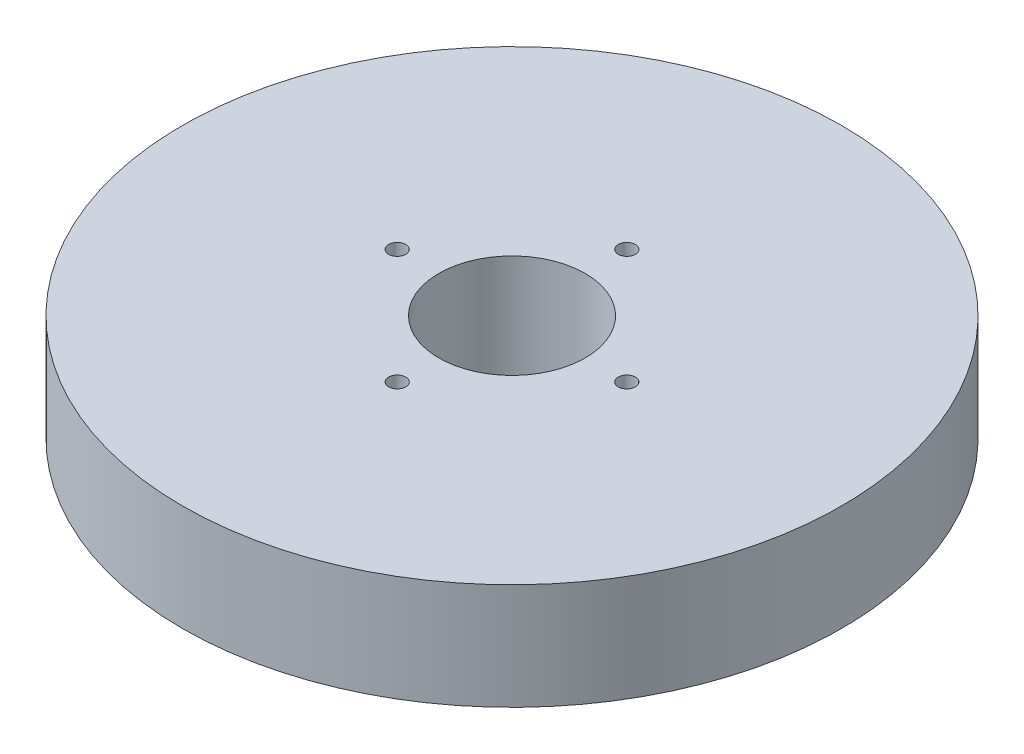
ISO-10303-21;
HEADER;
FILE_DESCRIPTION(('STEP AP214'),'2;1');
FILE_NAME('part.step','',(''),(''),'','','');
FILE_SCHEMA(('AUTOMOTIVE_DESIGN { 1 0 10303 214 1 1 1 1 }'));
ENDSEC;
DATA;
#1=APPLICATION_CONTEXT('core data for automotive mechanical design processes');
#2=APPLICATION_PROTOCOL_DEFINITION('international standard','automotive_design',2000,#1);
#3=PRODUCT_CONTEXT('',#1,'mechanical');
#4=PRODUCT('Part','Part','',(#3));
#5=PRODUCT_RELATED_PRODUCT_CATEGORY('part','',(#4));
#6=PRODUCT_DEFINITION_FORMATION('','',#4);
#7=PRODUCT_DEFINITION_CONTEXT('part definition',#1,'design');
#8=PRODUCT_DEFINITION('design','',#6,#7);
#9=PRODUCT_DEFINITION_SHAPE('','',#8);
#10=(LENGTH_UNIT() NAMED_UNIT(*) SI_UNIT(.MILLI.,.METRE.));
#11=(NAMED_UNIT(*) PLANE_ANGLE_UNIT() SI_UNIT($,.RADIAN.));
#12=(NAMED_UNIT(*) SI_UNIT($,.STERADIAN.) SOLID_ANGLE_UNIT());
#13=UNCERTAINTY_MEASURE_WITH_UNIT(LENGTH_MEASURE(1.E-05),#10,'distance_accuracy_value','');
#14=(GEOMETRIC_REPRESENTATION_CONTEXT(3) GLOBAL_UNCERTAINTY_ASSIGNED_CONTEXT((#13)) GLOBAL_UNIT_ASSIGNED_CONTEXT((#10,
#11,#12)) REPRESENTATION_CONTEXT('',''));
#15=CARTESIAN_POINT('',(0.,0.,0.));
#16=DIRECTION('',(0.,0.,1.));
#17=DIRECTION('',(1.,0.,0.));
#18=AXIS2_PLACEMENT_3D('',#15,#16,#17);
#19=CARTESIAN_POINT('',(0.,29.,0.));
#20=DIRECTION('',(0.,-1.,0.));
#21=DIRECTION('',(0.,0.,-1.));
#22=AXIS2_PLACEMENT_3D('',#19,#20,#21);
#23=CYLINDRICAL_SURFACE('',#22,90.);
#24=CARTESIAN_POINT('',(0.,29.,0.));
#25=DIRECTION('',(0.,1.,0.));
#26=DIRECTION('',(0.,0.,1.));
#27=AXIS2_PLACEMENT_3D('',#24,#25,#26);
#28=CIRCLE('',#27,90.);
#29=CARTESIAN_POINT('',(0.,29.,-90.));
#30=VERTEX_POINT('',#29);
#31=EDGE_CURVE('E10',#30,#30,#28,.T.);
#32=CARTESIAN_POINT('',(0.,0.,0.));
#33=DIRECTION('',(0.,1.,0.));
#34=DIRECTION('',(0.,0.,1.));
#35=AXIS2_PLACEMENT_3D('',#32,#33,#34);
#36=CIRCLE('',#35,90.);
#37=CARTESIAN_POINT('',(0.,0.,-90.));
#38=VERTEX_POINT('',#37);
#39=EDGE_CURVE('E37',#38,#38,#36,.T.);
#40=CARTESIAN_POINT('',(0.,29.,-90.));
#41=CARTESIAN_POINT('',(0.,28.6979166666667,-90.));
#42=CARTESIAN_POINT('',(0.,28.3958333333333,-90.));
#43=CARTESIAN_POINT('',(0.,27.7916666666667,-90.));
#44=CARTESIAN_POINT('',(0.,27.4895833333333,-90.));
#45=CARTESIAN_POINT('',(0.,26.8854166666667,-90.));
#46=CARTESIAN_POINT('',(0.,26.5833333333333,-90.));
#47=CARTESIAN_POINT('',(0.,25.9791666666667,-90.));
#48=CARTESIAN_POINT('',(0.,25.6770833333333,-90.));
#49=CARTESIAN_POINT('',(0.,25.0729166666667,-90.));
#50=CARTESIAN_POINT('',(0.,24.7708333333333,-90.));
#51=CARTESIAN_POINT('',(0.,24.1666666666667,-90.));
#52=CARTESIAN_POINT('',(0.,23.8645833333333,-90.));
#53=CARTESIAN_POINT('',(0.,23.2604166666667,-90.));
#54=CARTESIAN_POINT('',(0.,22.9583333333333,-90.));
#55=CARTESIAN_POINT('',(0.,22.3541666666667,-90.));
#56=CARTESIAN_POINT('',(0.,22.0520833333333,-90.));
#57=CARTESIAN_POINT('',(0.,21.4479166666667,-90.));
#58=CARTESIAN_POINT('',(0.,21.1458333333333,-90.));
#59=CARTESIAN_POINT('',(0.,20.5416666666667,-90.));
#60=CARTESIAN_POINT('',(0.,20.2395833333333,-90.));
#61=CARTESIAN_POINT('',(0.,19.6354166666667,-90.));
#62=CARTESIAN_POINT('',(0.,19.3333333333333,-90.));
#63=CARTESIAN_POINT('',(0.,18.7291666666667,-90.));
#64=CARTESIAN_POINT('',(0.,18.4270833333333,-90.));
#65=CARTESIAN_POINT('',(0.,17.8229166666667,-90.));
#66=CARTESIAN_POINT('',(0.,17.5208333333333,-90.));
#67=CARTESIAN_POINT('',(0.,16.9166666666667,-90.));
#68=CARTESIAN_POINT('',(0.,16.6145833333333,-90.));
#69=CARTESIAN_POINT('',(0.,16.0104166666667,-90.));
#70=CARTESIAN_POINT('',(0.,15.7083333333333,-90.));
#71=CARTESIAN_POINT('',(0.,15.1041666666667,-90.));
#72=CARTESIAN_POINT('',(0.,14.8020833333333,-90.));
#73=CARTESIAN_POINT('',(0.,14.1979166666667,-90.));
#74=CARTESIAN_POINT('',(0.,13.8958333333333,-90.));
#75=CARTESIAN_POINT('',(0.,13.2916666666667,-90.));
#76=CARTESIAN_POINT('',(0.,12.9895833333333,-90.));
#77=CARTESIAN_POINT('',(0.,12.3854166666667,-90.));
#78=CARTESIAN_POINT('',(0.,12.0833333333333,-90.));
#79=CARTESIAN_POINT('',(0.,11.4791666666667,-90.));
#80=CARTESIAN_POINT('',(0.,11.1770833333333,-90.));
#81=CARTESIAN_POINT('',(0.,10.5729166666667,-90.));
#82=CARTESIAN_POINT('',(0.,10.2708333333333,-90.));
#83=CARTESIAN_POINT('',(0.,9.66666666666667,-90.));
#84=CARTESIAN_POINT('',(0.,9.36458333333333,-90.));
#85=CARTESIAN_POINT('',(0.,8.76041666666667,-90.));
#86=CARTESIAN_POINT('',(0.,8.45833333333333,-90.));
#87=CARTESIAN_POINT('',(0.,7.85416666666667,-90.));
#88=CARTESIAN_POINT('',(0.,7.55208333333333,-90.));
#89=CARTESIAN_POINT('',(0.,6.94791666666667,-90.));
#90=CARTESIAN_POINT('',(0.,6.64583333333333,-90.));
#91=CARTESIAN_POINT('',(0.,6.04166666666667,-90.));
#92=CARTESIAN_POINT('',(0.,5.73958333333333,-90.));
#93=CARTESIAN_POINT('',(0.,5.13541666666667,-90.));
#94=CARTESIAN_POINT('',(0.,4.83333333333333,-90.));
#95=CARTESIAN_POINT('',(0.,4.22916666666667,-90.));
#96=CARTESIAN_POINT('',(0.,3.92708333333333,-90.));
#97=CARTESIAN_POINT('',(0.,3.32291666666667,-90.));
#98=CARTESIAN_POINT('',(0.,3.02083333333333,-90.));
#99=CARTESIAN_POINT('',(0.,2.41666666666667,-90.));
#100=CARTESIAN_POINT('',(0.,2.11458333333333,-90.));
#101=CARTESIAN_POINT('',(0.,1.51041666666667,-90.));
#102=CARTESIAN_POINT('',(0.,1.20833333333333,-90.));
#103=CARTESIAN_POINT('',(0.,0.604166666666667,-90.));
#104=CARTESIAN_POINT('',(0.,0.302083333333333,-90.));
#105=CARTESIAN_POINT('',(0.,0.,-90.));
#106=B_SPLINE_CURVE_WITH_KNOTS('',3,(#40,#41,#42,#43,#44,#45,#46,#47,#48,#49,#50,#51,#52,#53,
#54,#55,#56,#57,#58,#59,#60,#61,#62,#63,#64,#65,#66,#67,#68,#69,#70,#71,#72,#73,#74,#75,#76,#77,
#78,#79,#80,#81,#82,#83,#84,#85,#86,#87,#88,#89,#90,#91,#92,#93,#94,#95,#96,#97,#98,#99,#100,
#101,#102,#103,#104,#105),.UNSPECIFIED.,.F.,.F.,(4,2,2,2,2,2,2,2,2,2,2,2,2,2,2,2,2,2,2,2,2,2,2,
2,2,2,2,2,2,2,2,2,4),(0.,0.906250000000001,1.8125,2.71875,3.625,4.53125,5.4375,6.34375,7.25,
8.15625,9.0625,9.96875,10.875,11.78125,12.6875,13.59375,14.5,15.40625,16.3125,17.21875,18.125,
19.03125,19.9375,20.84375,21.75,22.65625,23.5625,24.46875,25.375,26.28125,27.1875,28.09375,29.),.UNSPECIFIED.);
#107=EDGE_CURVE('BSEAM40',#30,#38,#106,.T.);
#108=ORIENTED_EDGE('',*,*,#31,.F.);
#109=ORIENTED_EDGE('',*,*,#39,.T.);
#110=ORIENTED_EDGE('',*,*,#107,.T.);
#111=ORIENTED_EDGE('',*,*,#107,.F.);
#112=EDGE_LOOP('',(#108,#110,#109,#111));
#113=FACE_BOUND('',#112,.T.);
#114=ADVANCED_FACE('F40',(#113),#23,.T.);
#115=CARTESIAN_POINT('',(0.,29.,0.));
#116=DIRECTION('',(0.,1.,0.));
#117=DIRECTION('',(0.,0.,1.));
#118=AXIS2_PLACEMENT_3D('',#115,#116,#117);
#119=PLANE('',#118);
#120=CARTESIAN_POINT('',(1.09466292465393E-13,29.,31.352392248977));
#121=DIRECTION('',(0.,1.,0.));
#122=DIRECTION('',(1.,0.,0.));
#123=AXIS2_PLACEMENT_3D('',#120,#121,#122);
#124=CIRCLE('',#123,2.33870307675586);
#125=CARTESIAN_POINT('',(2.33870307675597,29.,31.352392248977));
#126=VERTEX_POINT('',#125);
#127=EDGE_CURVE('E71',#126,#126,#124,.T.);
#128=ORIENTED_EDGE('',*,*,#127,.F.);
#129=EDGE_LOOP('',(#128));
#130=FACE_BOUND('',#129,.T.);
#131=CARTESIAN_POINT('',(31.352392248977,29.,0.));
#132=DIRECTION('',(0.,1.,0.));
#133=DIRECTION('',(0.,0.,-1.));
#134=AXIS2_PLACEMENT_3D('',#131,#132,#133);
#135=CIRCLE('',#134,2.33870307675586);
#136=CARTESIAN_POINT('',(31.352392248977,29.,-2.33870307675586));
#137=VERTEX_POINT('',#136);
#138=EDGE_CURVE('E70',#137,#137,#135,.T.);
#139=ORIENTED_EDGE('',*,*,#138,.F.);
#140=EDGE_LOOP('',(#139));
#141=FACE_BOUND('',#140,.T.);
#142=CARTESIAN_POINT('',(-3.2839887739618E-13,29.,-31.352392248977));
#143=DIRECTION('',(0.,1.,0.));
#144=DIRECTION('',(-1.,0.,0.));
#145=AXIS2_PLACEMENT_3D('',#142,#143,#144);
#146=CIRCLE('',#145,2.33870307675586);
#147=CARTESIAN_POINT('',(-2.33870307675618,29.,-31.352392248977));
#148=VERTEX_POINT('',#147);
#149=EDGE_CURVE('E61',#148,#148,#146,.T.);
#150=ORIENTED_EDGE('',*,*,#149,.F.);
#151=EDGE_LOOP('',(#150));
#152=FACE_BOUND('',#151,.T.);
#153=CARTESIAN_POINT('',(-31.352392248977,29.,0.));
#154=DIRECTION('',(0.,1.,0.));
#155=DIRECTION('',(0.,0.,1.));
#156=AXIS2_PLACEMENT_3D('',#153,#154,#155);
#157=CIRCLE('',#156,2.33870307675586);
#158=CARTESIAN_POINT('',(-31.352392248977,29.,2.33870307675586));
#159=VERTEX_POINT('',#158);
#160=EDGE_CURVE('E54',#159,#159,#157,.T.);
#161=ORIENTED_EDGE('',*,*,#160,.F.);
#162=EDGE_LOOP('',(#161));
#163=FACE_BOUND('',#162,.T.);
#164=CARTESIAN_POINT('',(0.,29.,0.));
#165=DIRECTION('',(0.,1.,0.));
#166=DIRECTION('',(0.,0.,1.));
#167=AXIS2_PLACEMENT_3D('',#164,#165,#166);
#168=CIRCLE('',#167,20.);
#169=CARTESIAN_POINT('',(0.,29.,-20.));
#170=VERTEX_POINT('',#169);
#171=EDGE_CURVE('E50',#170,#170,#168,.T.);
#172=ORIENTED_EDGE('',*,*,#171,.F.);
#173=EDGE_LOOP('',(#172));
#174=FACE_BOUND('',#173,.T.);
#175=ORIENTED_EDGE('',*,*,#31,.T.);
#176=EDGE_LOOP('',(#175));
#177=FACE_BOUND('',#176,.T.);
#178=ADVANCED_FACE('F86',(#130,#141,#152,#163,#174,#177),#119,.T.);
#179=CARTESIAN_POINT('',(0.,0.,0.));
#180=DIRECTION('',(0.,1.,0.));
#181=DIRECTION('',(0.,0.,1.));
#182=AXIS2_PLACEMENT_3D('',#179,#180,#181);
#183=PLANE('',#182);
#184=CARTESIAN_POINT('',(0.,0.,0.));
#185=DIRECTION('',(0.,1.,0.));
#186=DIRECTION('',(0.,0.,1.));
#187=AXIS2_PLACEMENT_3D('',#184,#185,#186);
#188=CIRCLE('',#187,20.);
#189=CARTESIAN_POINT('',(0.,0.,-20.));
#190=VERTEX_POINT('',#189);
#191=EDGE_CURVE('E47',#190,#190,#188,.T.);
#192=ORIENTED_EDGE('',*,*,#191,.T.);
#193=EDGE_LOOP('',(#192));
#194=FACE_BOUND('',#193,.T.);
#195=ORIENTED_EDGE('',*,*,#39,.F.);
#196=EDGE_LOOP('',(#195));
#197=FACE_BOUND('',#196,.T.);
#198=ADVANCED_FACE('F93',(#194,#197),#183,.F.);
#199=CARTESIAN_POINT('',(0.,29.,0.));
#200=DIRECTION('',(0.,-1.,0.));
#201=DIRECTION('',(0.,0.,-1.));
#202=AXIS2_PLACEMENT_3D('',#199,#200,#201);
#203=CYLINDRICAL_SURFACE('',#202,20.);
#204=CARTESIAN_POINT('',(0.,29.,-20.));
#205=CARTESIAN_POINT('',(0.,28.6979166666667,-20.));
#206=CARTESIAN_POINT('',(0.,28.3958333333333,-20.));
#207=CARTESIAN_POINT('',(0.,27.7916666666667,-20.));
#208=CARTESIAN_POINT('',(0.,27.4895833333333,-20.));
#209=CARTESIAN_POINT('',(0.,26.8854166666667,-20.));
#210=CARTESIAN_POINT('',(0.,26.5833333333333,-20.));
#211=CARTESIAN_POINT('',(0.,25.9791666666667,-20.));
#212=CARTESIAN_POINT('',(0.,25.6770833333333,-20.));
#213=CARTESIAN_POINT('',(0.,25.0729166666667,-20.));
#214=CARTESIAN_POINT('',(0.,24.7708333333333,-20.));
#215=CARTESIAN_POINT('',(0.,24.1666666666667,-20.));
#216=CARTESIAN_POINT('',(0.,23.8645833333333,-20.));
#217=CARTESIAN_POINT('',(0.,23.2604166666667,-20.));
#218=CARTESIAN_POINT('',(0.,22.9583333333333,-20.));
#219=CARTESIAN_POINT('',(0.,22.3541666666667,-20.));
#220=CARTESIAN_POINT('',(0.,22.0520833333333,-20.));
#221=CARTESIAN_POINT('',(0.,21.4479166666667,-20.));
#222=CARTESIAN_POINT('',(0.,21.1458333333333,-20.));
#223=CARTESIAN_POINT('',(0.,20.5416666666667,-20.));
#224=CARTESIAN_POINT('',(0.,20.2395833333333,-20.));
#225=CARTESIAN_POINT('',(0.,19.6354166666667,-20.));
#226=CARTESIAN_POINT('',(0.,19.3333333333333,-20.));
#227=CARTESIAN_POINT('',(0.,18.7291666666667,-20.));
#228=CARTESIAN_POINT('',(0.,18.4270833333333,-20.));
#229=CARTESIAN_POINT('',(0.,17.8229166666667,-20.));
#230=CARTESIAN_POINT('',(0.,17.5208333333333,-20.));
#231=CARTESIAN_POINT('',(0.,16.9166666666667,-20.));
#232=CARTESIAN_POINT('',(0.,16.6145833333333,-20.));
#233=CARTESIAN_POINT('',(0.,16.0104166666667,-20.));
#234=CARTESIAN_POINT('',(0.,15.7083333333333,-20.));
#235=CARTESIAN_POINT('',(0.,15.1041666666667,-20.));
#236=CARTESIAN_POINT('',(0.,14.8020833333333,-20.));
#237=CARTESIAN_POINT('',(0.,14.1979166666667,-20.));
#238=CARTESIAN_POINT('',(0.,13.8958333333333,-20.));
#239=CARTESIAN_POINT('',(0.,13.2916666666667,-20.));
#240=CARTESIAN_POINT('',(0.,12.9895833333333,-20.));
#241=CARTESIAN_POINT('',(0.,12.3854166666667,-20.));
#242=CARTESIAN_POINT('',(0.,12.0833333333333,-20.));
#243=CARTESIAN_POINT('',(0.,11.4791666666667,-20.));
#244=CARTESIAN_POINT('',(0.,11.1770833333333,-20.));
#245=CARTESIAN_POINT('',(0.,10.5729166666667,-20.));
#246=CARTESIAN_POINT('',(0.,10.2708333333333,-20.));
#247=CARTESIAN_POINT('',(0.,9.66666666666667,-20.));
#248=CARTESIAN_POINT('',(0.,9.36458333333333,-20.));
#249=CARTESIAN_POINT('',(0.,8.76041666666667,-20.));
#250=CARTESIAN_POINT('',(0.,8.45833333333333,-20.));
#251=CARTESIAN_POINT('',(0.,7.85416666666667,-20.));
#252=CARTESIAN_POINT('',(0.,7.55208333333333,-20.));
#253=CARTESIAN_POINT('',(0.,6.94791666666667,-20.));
#254=CARTESIAN_POINT('',(0.,6.64583333333333,-20.));
#255=CARTESIAN_POINT('',(0.,6.04166666666667,-20.));
#256=CARTESIAN_POINT('',(0.,5.73958333333333,-20.));
#257=CARTESIAN_POINT('',(0.,5.13541666666667,-20.));
#258=CARTESIAN_POINT('',(0.,4.83333333333333,-20.));
#259=CARTESIAN_POINT('',(0.,4.22916666666667,-20.));
#260=CARTESIAN_POINT('',(0.,3.92708333333333,-20.));
#261=CARTESIAN_POINT('',(0.,3.32291666666667,-20.));
#262=CARTESIAN_POINT('',(0.,3.02083333333333,-20.));
#263=CARTESIAN_POINT('',(0.,2.41666666666667,-20.));
#264=CARTESIAN_POINT('',(0.,2.11458333333333,-20.));
#265=CARTESIAN_POINT('',(0.,1.51041666666667,-20.));
#266=CARTESIAN_POINT('',(0.,1.20833333333333,-20.));
#267=CARTESIAN_POINT('',(0.,0.604166666666667,-20.));
#268=CARTESIAN_POINT('',(0.,0.302083333333333,-20.));
#269=CARTESIAN_POINT('',(0.,0.,-20.));
#270=B_SPLINE_CURVE_WITH_KNOTS('',3,(#204,#205,#206,#207,#208,#209,#210,#211,#212,#213,#214,
#215,#216,#217,#218,#219,#220,#221,#222,#223,#224,#225,#226,#227,#228,#229,#230,#231,#232,#233,
#234,#235,#236,#237,#238,#239,#240,#241,#242,#243,#244,#245,#246,#247,#248,#249,#250,#251,#252,
#253,#254,#255,#256,#257,#258,#259,#260,#261,#262,#263,#264,#265,#266,#267,#268,#269),
.UNSPECIFIED.,.F.,.F.,(4,2,2,2,2,2,2,2,2,2,2,2,2,2,2,2,2,2,2,2,2,2,2,2,2,2,2,2,2,2,2,2,4),(0.,
0.906249999999997,1.8125,2.71875,3.625,4.53125,5.4375,6.34375,7.25,8.15625,9.0625,9.96875,
10.875,11.78125,12.6875,13.59375,14.5,15.40625,16.3125,17.21875,18.125,19.03125,19.9375,
20.84375,21.75,22.65625,23.5625,24.46875,25.375,26.28125,27.1875,28.09375,29.),.UNSPECIFIED.);
#271=EDGE_CURVE('BSEAM101',#170,#190,#270,.T.);
#272=ORIENTED_EDGE('',*,*,#171,.T.);
#273=ORIENTED_EDGE('',*,*,#191,.F.);
#274=ORIENTED_EDGE('',*,*,#271,.T.);
#275=ORIENTED_EDGE('',*,*,#271,.F.);
#276=EDGE_LOOP('',(#272,#274,#273,#275));
#277=FACE_BOUND('',#276,.T.);
#278=ADVANCED_FACE('F101',(#277),#203,.F.);
#279=CARTESIAN_POINT('',(-31.352392248977,9.66986134545247,0.));
#280=DIRECTION('',(0.,1.,0.));
#281=DIRECTION('',(0.,0.,1.));
#282=AXIS2_PLACEMENT_3D('',#279,#280,#281);
#283=CYLINDRICAL_SURFACE('',#282,2.33870307675586);
#284=CARTESIAN_POINT('',(-31.352392248977,9.66986134545247,0.));
#285=DIRECTION('',(0.,1.,0.));
#286=DIRECTION('',(0.,0.,1.));
#287=AXIS2_PLACEMENT_3D('',#284,#285,#286);
#288=CIRCLE('',#287,2.33870307675586);
#289=CARTESIAN_POINT('',(-31.352392248977,9.66986134545247,2.33870307675586));
#290=VERTEX_POINT('',#289);
#291=EDGE_CURVE('E55',#290,#290,#288,.T.);
#292=ORIENTED_EDGE('',*,*,#291,.F.);
#293=EDGE_LOOP('',(#292));
#294=FACE_BOUND('',#293,.T.);
#295=ORIENTED_EDGE('',*,*,#160,.T.);
#296=EDGE_LOOP('',(#295));
#297=FACE_BOUND('',#296,.T.);
#298=ADVANCED_FACE('F102',(#294,#297),#283,.F.);
#299=CARTESIAN_POINT('',(-31.352392248977,9.66986134545247,0.));
#300=DIRECTION('',(0.,1.,0.));
#301=DIRECTION('',(0.,0.,1.));
#302=AXIS2_PLACEMENT_3D('',#299,#300,#301);
#303=PLANE('',#302);
#304=ORIENTED_EDGE('',*,*,#291,.T.);
#305=EDGE_LOOP('',(#304));
#306=FACE_BOUND('',#305,.T.);
#307=ADVANCED_FACE('F133',(#306),#303,.T.);
#308=CARTESIAN_POINT('',(-3.2839887739618E-13,9.66986134545247,-31.352392248977));
#309=DIRECTION('',(0.,1.,0.));
#310=DIRECTION('',(0.,0.,1.));
#311=AXIS2_PLACEMENT_3D('',#308,#309,#310);
#312=CYLINDRICAL_SURFACE('',#311,2.33870307675586);
#313=CARTESIAN_POINT('',(-3.2839887739618E-13,9.66986134545247,-31.352392248977));
#314=DIRECTION('',(0.,1.,0.));
#315=DIRECTION('',(-1.,0.,0.));
#316=AXIS2_PLACEMENT_3D('',#313,#314,#315);
#317=CIRCLE('',#316,2.33870307675586);
#318=CARTESIAN_POINT('',(-2.33870307675618,9.66986134545247,-31.352392248977));
#319=VERTEX_POINT('',#318);
#320=EDGE_CURVE('E63',#319,#319,#317,.T.);
#321=ORIENTED_EDGE('',*,*,#320,.F.);
#322=EDGE_LOOP('',(#321));
#323=FACE_BOUND('',#322,.T.);
#324=ORIENTED_EDGE('',*,*,#149,.T.);
#325=EDGE_LOOP('',(#324));
#326=FACE_BOUND('',#325,.T.);
#327=ADVANCED_FACE('F142',(#323,#326),#312,.F.);
#328=CARTESIAN_POINT('',(-3.2839887739618E-13,9.66986134545247,-31.352392248977));
#329=DIRECTION('',(0.,1.,0.));
#330=DIRECTION('',(-1.,0.,0.));
#331=AXIS2_PLACEMENT_3D('',#328,#329,#330);
#332=PLANE('',#331);
#333=ORIENTED_EDGE('',*,*,#320,.T.);
#334=EDGE_LOOP('',(#333));
#335=FACE_BOUND('',#334,.T.);
#336=ADVANCED_FACE('F156',(#335),#332,.T.);
#337=CARTESIAN_POINT('',(31.352392248977,9.66986134545247,0.));
#338=DIRECTION('',(0.,1.,0.));
#339=DIRECTION('',(0.,0.,1.));
#340=AXIS2_PLACEMENT_3D('',#337,#338,#339);
#341=CYLINDRICAL_SURFACE('',#340,2.33870307675586);
#342=CARTESIAN_POINT('',(31.352392248977,9.66986134545247,0.));
#343=DIRECTION('',(0.,1.,0.));
#344=DIRECTION('',(0.,0.,-1.));
#345=AXIS2_PLACEMENT_3D('',#342,#343,#344);
#346=CIRCLE('',#345,2.33870307675586);
#347=CARTESIAN_POINT('',(31.352392248977,9.66986134545247,-2.33870307675586));
#348=VERTEX_POINT('',#347);
#349=EDGE_CURVE('E69',#348,#348,#346,.T.);
#350=ORIENTED_EDGE('',*,*,#349,.F.);
#351=EDGE_LOOP('',(#350));
#352=FACE_BOUND('',#351,.T.);
#353=ORIENTED_EDGE('',*,*,#138,.T.);
#354=EDGE_LOOP('',(#353));
#355=FACE_BOUND('',#354,.T.);
#356=ADVANCED_FACE('F164',(#352,#355),#341,.F.);
#357=CARTESIAN_POINT('',(31.352392248977,9.66986134545247,0.));
#358=DIRECTION('',(0.,1.,0.));
#359=DIRECTION('',(0.,0.,-1.));
#360=AXIS2_PLACEMENT_3D('',#357,#358,#359);
#361=PLANE('',#360);
#362=ORIENTED_EDGE('',*,*,#349,.T.);
#363=EDGE_LOOP('',(#362));
#364=FACE_BOUND('',#363,.T.);
#365=ADVANCED_FACE('F83',(#364),#361,.T.);
#366=CARTESIAN_POINT('',(1.09466292465393E-13,9.66986134545247,31.352392248977));
#367=DIRECTION('',(0.,1.,0.));
#368=DIRECTION('',(0.,0.,1.));
#369=AXIS2_PLACEMENT_3D('',#366,#367,#368);
#370=CYLINDRICAL_SURFACE('',#369,2.33870307675586);
#371=CARTESIAN_POINT('',(1.09466292465393E-13,9.66986134545247,31.352392248977));
#372=DIRECTION('',(0.,1.,0.));
#373=DIRECTION('',(1.,0.,0.));
#374=AXIS2_PLACEMENT_3D('',#371,#372,#373);
#375=CIRCLE('',#374,2.33870307675586);
#376=CARTESIAN_POINT('',(2.33870307675597,9.66986134545247,31.352392248977));
#377=VERTEX_POINT('',#376);
#378=EDGE_CURVE('E59',#377,#377,#375,.T.);
#379=ORIENTED_EDGE('',*,*,#378,.F.);
#380=EDGE_LOOP('',(#379));
#381=FACE_BOUND('',#380,.T.);
#382=ORIENTED_EDGE('',*,*,#127,.T.);
#383=EDGE_LOOP('',(#382));
#384=FACE_BOUND('',#383,.T.);
#385=ADVANCED_FACE('F81',(#381,#384),#370,.F.);
#386=CARTESIAN_POINT('',(1.09466292465393E-13,9.66986134545247,31.352392248977));
#387=DIRECTION('',(0.,1.,0.));
#388=DIRECTION('',(1.,0.,0.));
#389=AXIS2_PLACEMENT_3D('',#386,#387,#388);
#390=PLANE('',#389);
#391=ORIENTED_EDGE('',*,*,#378,.T.);
#392=EDGE_LOOP('',(#391));
#393=FACE_BOUND('',#392,.T.);
#394=ADVANCED_FACE('F78',(#393),#390,.T.);
#395=CLOSED_SHELL('',(#114,#178,#198,#278,#298,#307,#327,#336,#356,#365,#385,#394));
#396=MANIFOLD_SOLID_BREP('B2',#395);
#397=ADVANCED_BREP_SHAPE_REPRESENTATION('',(#18,#396),#14);
#398=SHAPE_DEFINITION_REPRESENTATION(#9,#397);
ENDSEC;
END-ISO-10303-21;
